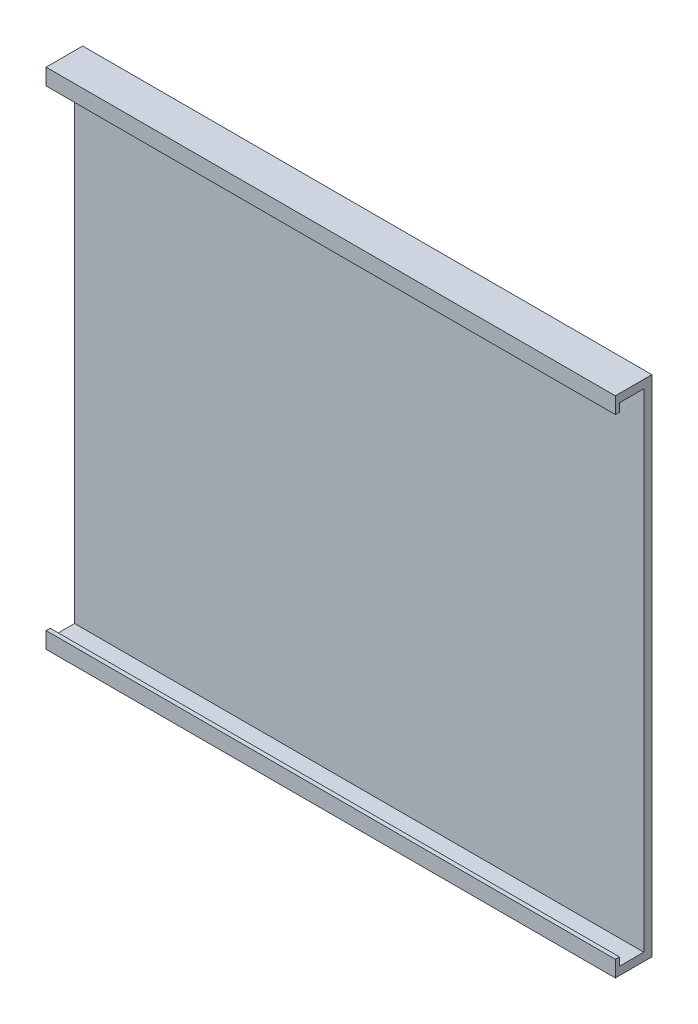
ISO-10303-21;
HEADER;
FILE_DESCRIPTION(('STEP AP214'),'2;1');
FILE_NAME('part.step','',(''),(''),'','','');
FILE_SCHEMA(('AUTOMOTIVE_DESIGN { 1 0 10303 214 1 1 1 1 }'));
ENDSEC;
DATA;
#1=APPLICATION_CONTEXT('core data for automotive mechanical design processes');
#2=APPLICATION_PROTOCOL_DEFINITION('international standard','automotive_design',2000,#1);
#3=PRODUCT_CONTEXT('',#1,'mechanical');
#4=PRODUCT('Part','Part','',(#3));
#5=PRODUCT_RELATED_PRODUCT_CATEGORY('part','',(#4));
#6=PRODUCT_DEFINITION_FORMATION('','',#4);
#7=PRODUCT_DEFINITION_CONTEXT('part definition',#1,'design');
#8=PRODUCT_DEFINITION('design','',#6,#7);
#9=PRODUCT_DEFINITION_SHAPE('','',#8);
#10=(LENGTH_UNIT() NAMED_UNIT(*) SI_UNIT(.MILLI.,.METRE.));
#11=(NAMED_UNIT(*) PLANE_ANGLE_UNIT() SI_UNIT($,.RADIAN.));
#12=(NAMED_UNIT(*) SI_UNIT($,.STERADIAN.) SOLID_ANGLE_UNIT());
#13=UNCERTAINTY_MEASURE_WITH_UNIT(LENGTH_MEASURE(1.E-05),#10,'distance_accuracy_value','');
#14=(GEOMETRIC_REPRESENTATION_CONTEXT(3) GLOBAL_UNCERTAINTY_ASSIGNED_CONTEXT((#13)) GLOBAL_UNIT_ASSIGNED_CONTEXT((#10,
#11,#12)) REPRESENTATION_CONTEXT('',''));
#15=CARTESIAN_POINT('',(0.,0.,0.));
#16=DIRECTION('',(0.,0.,1.));
#17=DIRECTION('',(1.,0.,0.));
#18=AXIS2_PLACEMENT_3D('',#15,#16,#17);
#19=CARTESIAN_POINT('',(0.,0.,1.));
#20=DIRECTION('',(0.,0.,-1.));
#21=DIRECTION('',(-1.,0.,0.));
#22=AXIS2_PLACEMENT_3D('',#19,#20,#21);
#23=PLANE('',#22);
#24=DIRECTION('',(0.,-1.,0.));
#25=VECTOR('',#24,1.);
#26=CARTESIAN_POINT('',(-45.8,45.6,1.));
#27=LINE('',#26,#25);
#28=CARTESIAN_POINT('',(-45.8,44.6,1.));
#29=VERTEX_POINT('',#28);
#30=CARTESIAN_POINT('',(-45.8,-15.4,1.));
#31=VERTEX_POINT('',#30);
#32=EDGE_CURVE('E240',#29,#31,#27,.T.);
#33=ORIENTED_EDGE('',*,*,#32,.T.);
#34=DIRECTION('',(-1.,0.,0.));
#35=VECTOR('',#34,1.);
#36=CARTESIAN_POINT('',(24.2,-15.4,1.));
#37=LINE('',#36,#35);
#38=CARTESIAN_POINT('',(24.2,-15.4,1.));
#39=VERTEX_POINT('',#38);
#40=EDGE_CURVE('E171',#39,#31,#37,.T.);
#41=ORIENTED_EDGE('',*,*,#40,.F.);
#42=DIRECTION('',(0.,-1.,0.));
#43=VECTOR('',#42,1.);
#44=CARTESIAN_POINT('',(24.2,45.6,1.));
#45=LINE('',#44,#43);
#46=CARTESIAN_POINT('',(24.2,44.6,1.));
#47=VERTEX_POINT('',#46);
#48=EDGE_CURVE('E237',#47,#39,#45,.T.);
#49=ORIENTED_EDGE('',*,*,#48,.F.);
#50=DIRECTION('',(-1.,0.,0.));
#51=VECTOR('',#50,1.);
#52=CARTESIAN_POINT('',(24.2,44.6,1.));
#53=LINE('',#52,#51);
#54=EDGE_CURVE('E141',#47,#29,#53,.T.);
#55=ORIENTED_EDGE('',*,*,#54,.T.);
#56=EDGE_LOOP('',(#33,#41,#49,#55));
#57=FACE_BOUND('',#56,.T.);
#58=ADVANCED_FACE('F45',(#57),#23,.F.);
#59=CARTESIAN_POINT('',(-45.8,-16.4,1.));
#60=DIRECTION('',(0.,1.,0.));
#61=DIRECTION('',(0.,0.,1.));
#62=AXIS2_PLACEMENT_3D('',#59,#60,#61);
#63=PLANE('',#62);
#64=DIRECTION('',(1.,0.,0.));
#65=VECTOR('',#64,1.);
#66=CARTESIAN_POINT('',(-45.8,-16.4,0.));
#67=LINE('',#66,#65);
#68=CARTESIAN_POINT('',(-45.8,-16.4,0.));
#69=VERTEX_POINT('',#68);
#70=CARTESIAN_POINT('',(24.2,-16.4,0.));
#71=VERTEX_POINT('',#70);
#72=EDGE_CURVE('E236',#69,#71,#67,.T.);
#73=ORIENTED_EDGE('',*,*,#72,.T.);
#74=DIRECTION('',(0.,0.,-1.));
#75=VECTOR('',#74,1.);
#76=CARTESIAN_POINT('',(24.2,-16.4,1.));
#77=LINE('',#76,#75);
#78=CARTESIAN_POINT('',(24.2,-16.4,4.5));
#79=VERTEX_POINT('',#78);
#80=EDGE_CURVE('E11',#79,#71,#77,.T.);
#81=ORIENTED_EDGE('',*,*,#80,.F.);
#82=DIRECTION('',(1.,0.,0.));
#83=VECTOR('',#82,1.);
#84=CARTESIAN_POINT('',(-45.8,-16.4,4.5));
#85=LINE('',#84,#83);
#86=CARTESIAN_POINT('',(-45.8,-16.4,4.5));
#87=VERTEX_POINT('',#86);
#88=EDGE_CURVE('E207',#87,#79,#85,.T.);
#89=ORIENTED_EDGE('',*,*,#88,.F.);
#90=DIRECTION('',(0.,0.,-1.));
#91=VECTOR('',#90,1.);
#92=CARTESIAN_POINT('',(-45.8,-16.4,1.));
#93=LINE('',#92,#91);
#94=EDGE_CURVE('E244',#87,#69,#93,.T.);
#95=ORIENTED_EDGE('',*,*,#94,.T.);
#96=EDGE_LOOP('',(#73,#81,#89,#95));
#97=FACE_BOUND('',#96,.T.);
#98=ADVANCED_FACE('F47',(#97),#63,.F.);
#99=CARTESIAN_POINT('',(24.2,45.6,1.));
#100=DIRECTION('',(1.,0.,0.));
#101=DIRECTION('',(0.,1.,0.));
#102=AXIS2_PLACEMENT_3D('',#99,#100,#101);
#103=PLANE('',#102);
#104=DIRECTION('',(0.,0.,-1.));
#105=VECTOR('',#104,1.);
#106=CARTESIAN_POINT('',(24.2,44.6,1.));
#107=LINE('',#106,#105);
#108=CARTESIAN_POINT('',(24.2,44.6,4.));
#109=VERTEX_POINT('',#108);
#110=EDGE_CURVE('E146',#109,#47,#107,.T.);
#111=ORIENTED_EDGE('',*,*,#110,.T.);
#112=ORIENTED_EDGE('',*,*,#48,.T.);
#113=DIRECTION('',(0.,0.,1.));
#114=VECTOR('',#113,1.);
#115=CARTESIAN_POINT('',(24.2,-15.4,1.));
#116=LINE('',#115,#114);
#117=CARTESIAN_POINT('',(24.2,-15.4,4.));
#118=VERTEX_POINT('',#117);
#119=EDGE_CURVE('E184',#39,#118,#116,.T.);
#120=ORIENTED_EDGE('',*,*,#119,.T.);
#121=DIRECTION('',(0.,1.,0.));
#122=VECTOR('',#121,1.);
#123=CARTESIAN_POINT('',(24.2,-14.4,4.));
#124=LINE('',#123,#122);
#125=CARTESIAN_POINT('',(24.2,-14.4,4.));
#126=VERTEX_POINT('',#125);
#127=EDGE_CURVE('E175',#118,#126,#124,.T.);
#128=ORIENTED_EDGE('',*,*,#127,.T.);
#129=DIRECTION('',(0.,0.,-1.));
#130=VECTOR('',#129,1.);
#131=CARTESIAN_POINT('',(24.2,-14.4,4.5));
#132=LINE('',#131,#130);
#133=CARTESIAN_POINT('',(24.2,-14.4,4.5));
#134=VERTEX_POINT('',#133);
#135=EDGE_CURVE('E167',#134,#126,#132,.T.);
#136=ORIENTED_EDGE('',*,*,#135,.F.);
#137=DIRECTION('',(0.,1.,0.));
#138=VECTOR('',#137,1.);
#139=CARTESIAN_POINT('',(24.2,-14.4,4.5));
#140=LINE('',#139,#138);
#141=EDGE_CURVE('E204',#79,#134,#140,.T.);
#142=ORIENTED_EDGE('',*,*,#141,.F.);
#143=ORIENTED_EDGE('',*,*,#80,.T.);
#144=DIRECTION('',(0.,-1.,0.));
#145=VECTOR('',#144,1.);
#146=CARTESIAN_POINT('',(24.2,45.6,0.));
#147=LINE('',#146,#145);
#148=CARTESIAN_POINT('',(24.2,45.6,0.));
#149=VERTEX_POINT('',#148);
#150=EDGE_CURVE('E248',#149,#71,#147,.T.);
#151=ORIENTED_EDGE('',*,*,#150,.F.);
#152=DIRECTION('',(0.,0.,-1.));
#153=VECTOR('',#152,1.);
#154=CARTESIAN_POINT('',(24.2,45.6,1.));
#155=LINE('',#154,#153);
#156=CARTESIAN_POINT('',(24.2,45.6,4.5));
#157=VERTEX_POINT('',#156);
#158=EDGE_CURVE('E54',#157,#149,#155,.T.);
#159=ORIENTED_EDGE('',*,*,#158,.F.);
#160=DIRECTION('',(0.,1.,0.));
#161=VECTOR('',#160,1.);
#162=CARTESIAN_POINT('',(24.2,45.6,4.5));
#163=LINE('',#162,#161);
#164=CARTESIAN_POINT('',(24.2,43.6,4.5));
#165=VERTEX_POINT('',#164);
#166=EDGE_CURVE('E222',#165,#157,#163,.T.);
#167=ORIENTED_EDGE('',*,*,#166,.F.);
#168=DIRECTION('',(0.,0.,-1.));
#169=VECTOR('',#168,1.);
#170=CARTESIAN_POINT('',(24.2,43.6,4.5));
#171=LINE('',#170,#169);
#172=CARTESIAN_POINT('',(24.2,43.6,4.));
#173=VERTEX_POINT('',#172);
#174=EDGE_CURVE('E156',#165,#173,#171,.T.);
#175=ORIENTED_EDGE('',*,*,#174,.T.);
#176=DIRECTION('',(0.,1.,0.));
#177=VECTOR('',#176,1.);
#178=CARTESIAN_POINT('',(24.2,43.6,4.));
#179=LINE('',#178,#177);
#180=EDGE_CURVE('E61',#173,#109,#179,.T.);
#181=ORIENTED_EDGE('',*,*,#180,.T.);
#182=EDGE_LOOP('',(#111,#112,#120,#128,#136,#142,#143,#151,#159,#167,#175,#181));
#183=FACE_BOUND('',#182,.T.);
#184=ADVANCED_FACE('F153',(#183),#103,.T.);
#185=CARTESIAN_POINT('',(-45.8,45.6,1.));
#186=DIRECTION('',(0.,1.,0.));
#187=DIRECTION('',(0.,0.,1.));
#188=AXIS2_PLACEMENT_3D('',#185,#186,#187);
#189=PLANE('',#188);
#190=DIRECTION('',(1.,0.,0.));
#191=VECTOR('',#190,1.);
#192=CARTESIAN_POINT('',(-45.8,45.6,0.));
#193=LINE('',#192,#191);
#194=CARTESIAN_POINT('',(-45.8,45.6,0.));
#195=VERTEX_POINT('',#194);
#196=EDGE_CURVE('E252',#195,#149,#193,.T.);
#197=ORIENTED_EDGE('',*,*,#196,.F.);
#198=DIRECTION('',(0.,0.,-1.));
#199=VECTOR('',#198,1.);
#200=CARTESIAN_POINT('',(-45.8,45.6,1.));
#201=LINE('',#200,#199);
#202=CARTESIAN_POINT('',(-45.8,45.6,4.5));
#203=VERTEX_POINT('',#202);
#204=EDGE_CURVE('E261',#203,#195,#201,.T.);
#205=ORIENTED_EDGE('',*,*,#204,.F.);
#206=DIRECTION('',(-1.,0.,0.));
#207=VECTOR('',#206,1.);
#208=CARTESIAN_POINT('',(-45.8,45.6,4.5));
#209=LINE('',#208,#207);
#210=EDGE_CURVE('E226',#157,#203,#209,.T.);
#211=ORIENTED_EDGE('',*,*,#210,.F.);
#212=ORIENTED_EDGE('',*,*,#158,.T.);
#213=EDGE_LOOP('',(#197,#205,#211,#212));
#214=FACE_BOUND('',#213,.T.);
#215=ADVANCED_FACE('F268',(#214),#189,.T.);
#216=CARTESIAN_POINT('',(-45.8,45.6,1.));
#217=DIRECTION('',(1.,0.,0.));
#218=DIRECTION('',(0.,1.,0.));
#219=AXIS2_PLACEMENT_3D('',#216,#217,#218);
#220=PLANE('',#219);
#221=ORIENTED_EDGE('',*,*,#32,.F.);
#222=DIRECTION('',(0.,0.,-1.));
#223=VECTOR('',#222,1.);
#224=CARTESIAN_POINT('',(-45.8,44.6,1.));
#225=LINE('',#224,#223);
#226=CARTESIAN_POINT('',(-45.8,44.6,4.));
#227=VERTEX_POINT('',#226);
#228=EDGE_CURVE('E158',#227,#29,#225,.T.);
#229=ORIENTED_EDGE('',*,*,#228,.F.);
#230=DIRECTION('',(0.,1.,0.));
#231=VECTOR('',#230,1.);
#232=CARTESIAN_POINT('',(-45.8,43.6,4.));
#233=LINE('',#232,#231);
#234=CARTESIAN_POINT('',(-45.8,43.6,4.));
#235=VERTEX_POINT('',#234);
#236=EDGE_CURVE('E136',#235,#227,#233,.T.);
#237=ORIENTED_EDGE('',*,*,#236,.F.);
#238=DIRECTION('',(0.,0.,-1.));
#239=VECTOR('',#238,1.);
#240=CARTESIAN_POINT('',(-45.8,43.6,4.5));
#241=LINE('',#240,#239);
#242=CARTESIAN_POINT('',(-45.8,43.6,4.5));
#243=VERTEX_POINT('',#242);
#244=EDGE_CURVE('E232',#243,#235,#241,.T.);
#245=ORIENTED_EDGE('',*,*,#244,.F.);
#246=DIRECTION('',(0.,-1.,0.));
#247=VECTOR('',#246,1.);
#248=CARTESIAN_POINT('',(-45.8,45.6,4.5));
#249=LINE('',#248,#247);
#250=EDGE_CURVE('E215',#203,#243,#249,.T.);
#251=ORIENTED_EDGE('',*,*,#250,.F.);
#252=ORIENTED_EDGE('',*,*,#204,.T.);
#253=DIRECTION('',(0.,-1.,0.));
#254=VECTOR('',#253,1.);
#255=CARTESIAN_POINT('',(-45.8,45.6,0.));
#256=LINE('',#255,#254);
#257=EDGE_CURVE('E241',#195,#69,#256,.T.);
#258=ORIENTED_EDGE('',*,*,#257,.T.);
#259=ORIENTED_EDGE('',*,*,#94,.F.);
#260=DIRECTION('',(0.,-1.,0.));
#261=VECTOR('',#260,1.);
#262=CARTESIAN_POINT('',(-45.8,-14.4,4.5));
#263=LINE('',#262,#261);
#264=CARTESIAN_POINT('',(-45.8,-14.4,4.5));
#265=VERTEX_POINT('',#264);
#266=EDGE_CURVE('E211',#265,#87,#263,.T.);
#267=ORIENTED_EDGE('',*,*,#266,.F.);
#268=DIRECTION('',(0.,0.,-1.));
#269=VECTOR('',#268,1.);
#270=CARTESIAN_POINT('',(-45.8,-14.4,4.5));
#271=LINE('',#270,#269);
#272=CARTESIAN_POINT('',(-45.8,-14.4,4.));
#273=VERTEX_POINT('',#272);
#274=EDGE_CURVE('E197',#265,#273,#271,.T.);
#275=ORIENTED_EDGE('',*,*,#274,.T.);
#276=DIRECTION('',(0.,1.,0.));
#277=VECTOR('',#276,1.);
#278=CARTESIAN_POINT('',(-45.8,-14.4,4.));
#279=LINE('',#278,#277);
#280=CARTESIAN_POINT('',(-45.8,-15.4,4.));
#281=VERTEX_POINT('',#280);
#282=EDGE_CURVE('E69',#281,#273,#279,.T.);
#283=ORIENTED_EDGE('',*,*,#282,.F.);
#284=DIRECTION('',(0.,0.,1.));
#285=VECTOR('',#284,1.);
#286=CARTESIAN_POINT('',(-45.8,-15.4,1.));
#287=LINE('',#286,#285);
#288=EDGE_CURVE('E164',#31,#281,#287,.T.);
#289=ORIENTED_EDGE('',*,*,#288,.F.);
#290=EDGE_LOOP('',(#221,#229,#237,#245,#251,#252,#258,#259,#267,#275,#283,#289));
#291=FACE_BOUND('',#290,.T.);
#292=ADVANCED_FACE('F275',(#291),#220,.F.);
#293=CARTESIAN_POINT('',(0.,0.,0.));
#294=DIRECTION('',(0.,0.,-1.));
#295=DIRECTION('',(-1.,0.,0.));
#296=AXIS2_PLACEMENT_3D('',#293,#294,#295);
#297=PLANE('',#296);
#298=ORIENTED_EDGE('',*,*,#72,.F.);
#299=ORIENTED_EDGE('',*,*,#257,.F.);
#300=ORIENTED_EDGE('',*,*,#196,.T.);
#301=ORIENTED_EDGE('',*,*,#150,.T.);
#302=EDGE_LOOP('',(#298,#299,#300,#301));
#303=FACE_BOUND('',#302,.T.);
#304=ADVANCED_FACE('F273',(#303),#297,.T.);
#305=CARTESIAN_POINT('',(-45.8,43.6,4.5));
#306=DIRECTION('',(0.,1.,0.));
#307=DIRECTION('',(0.,0.,1.));
#308=AXIS2_PLACEMENT_3D('',#305,#306,#307);
#309=PLANE('',#308);
#310=ORIENTED_EDGE('',*,*,#244,.T.);
#311=DIRECTION('',(-1.,0.,0.));
#312=VECTOR('',#311,1.);
#313=CARTESIAN_POINT('',(24.2,43.6,4.));
#314=LINE('',#313,#312);
#315=EDGE_CURVE('E142',#173,#235,#314,.T.);
#316=ORIENTED_EDGE('',*,*,#315,.F.);
#317=ORIENTED_EDGE('',*,*,#174,.F.);
#318=DIRECTION('',(1.,0.,0.));
#319=VECTOR('',#318,1.);
#320=CARTESIAN_POINT('',(-45.8,43.6,4.5));
#321=LINE('',#320,#319);
#322=EDGE_CURVE('E219',#243,#165,#321,.T.);
#323=ORIENTED_EDGE('',*,*,#322,.F.);
#324=EDGE_LOOP('',(#310,#316,#317,#323));
#325=FACE_BOUND('',#324,.T.);
#326=ADVANCED_FACE('F304',(#325),#309,.F.);
#327=CARTESIAN_POINT('',(0.,0.,4.5));
#328=DIRECTION('',(0.,0.,1.));
#329=DIRECTION('',(1.,0.,0.));
#330=AXIS2_PLACEMENT_3D('',#327,#328,#329);
#331=PLANE('',#330);
#332=ORIENTED_EDGE('',*,*,#250,.T.);
#333=ORIENTED_EDGE('',*,*,#322,.T.);
#334=ORIENTED_EDGE('',*,*,#166,.T.);
#335=ORIENTED_EDGE('',*,*,#210,.T.);
#336=EDGE_LOOP('',(#332,#333,#334,#335));
#337=FACE_BOUND('',#336,.T.);
#338=ADVANCED_FACE('F326',(#337),#331,.T.);
#339=CARTESIAN_POINT('',(-45.8,-14.4,4.5));
#340=DIRECTION('',(0.,-1.,0.));
#341=DIRECTION('',(0.,0.,-1.));
#342=AXIS2_PLACEMENT_3D('',#339,#340,#341);
#343=PLANE('',#342);
#344=ORIENTED_EDGE('',*,*,#135,.T.);
#345=DIRECTION('',(-1.,0.,0.));
#346=VECTOR('',#345,1.);
#347=CARTESIAN_POINT('',(24.2,-14.4,4.));
#348=LINE('',#347,#346);
#349=EDGE_CURVE('E179',#126,#273,#348,.T.);
#350=ORIENTED_EDGE('',*,*,#349,.T.);
#351=ORIENTED_EDGE('',*,*,#274,.F.);
#352=DIRECTION('',(-1.,0.,0.));
#353=VECTOR('',#352,1.);
#354=CARTESIAN_POINT('',(-45.8,-14.4,4.5));
#355=LINE('',#354,#353);
#356=EDGE_CURVE('E201',#134,#265,#355,.T.);
#357=ORIENTED_EDGE('',*,*,#356,.F.);
#358=EDGE_LOOP('',(#344,#350,#351,#357));
#359=FACE_BOUND('',#358,.T.);
#360=ADVANCED_FACE('F286',(#359),#343,.F.);
#361=CARTESIAN_POINT('',(0.,0.,4.5));
#362=DIRECTION('',(0.,0.,1.));
#363=DIRECTION('',(1.,0.,0.));
#364=AXIS2_PLACEMENT_3D('',#361,#362,#363);
#365=PLANE('',#364);
#366=ORIENTED_EDGE('',*,*,#266,.T.);
#367=ORIENTED_EDGE('',*,*,#88,.T.);
#368=ORIENTED_EDGE('',*,*,#141,.T.);
#369=ORIENTED_EDGE('',*,*,#356,.T.);
#370=EDGE_LOOP('',(#366,#367,#368,#369));
#371=FACE_BOUND('',#370,.T.);
#372=ADVANCED_FACE('F281',(#371),#365,.T.);
#373=CARTESIAN_POINT('',(24.2,-14.4,4.));
#374=DIRECTION('',(0.,0.,1.));
#375=DIRECTION('',(1.,0.,0.));
#376=AXIS2_PLACEMENT_3D('',#373,#374,#375);
#377=PLANE('',#376);
#378=ORIENTED_EDGE('',*,*,#282,.T.);
#379=ORIENTED_EDGE('',*,*,#349,.F.);
#380=ORIENTED_EDGE('',*,*,#127,.F.);
#381=DIRECTION('',(-1.,0.,0.));
#382=VECTOR('',#381,1.);
#383=CARTESIAN_POINT('',(24.2,-15.4,4.));
#384=LINE('',#383,#382);
#385=EDGE_CURVE('E176',#118,#281,#384,.T.);
#386=ORIENTED_EDGE('',*,*,#385,.T.);
#387=EDGE_LOOP('',(#378,#379,#380,#386));
#388=FACE_BOUND('',#387,.T.);
#389=ADVANCED_FACE('F289',(#388),#377,.F.);
#390=CARTESIAN_POINT('',(24.2,-15.4,1.));
#391=DIRECTION('',(0.,-1.,0.));
#392=DIRECTION('',(1.,0.,0.));
#393=AXIS2_PLACEMENT_3D('',#390,#391,#392);
#394=PLANE('',#393);
#395=ORIENTED_EDGE('',*,*,#288,.T.);
#396=ORIENTED_EDGE('',*,*,#385,.F.);
#397=ORIENTED_EDGE('',*,*,#119,.F.);
#398=ORIENTED_EDGE('',*,*,#40,.T.);
#399=EDGE_LOOP('',(#395,#396,#397,#398));
#400=FACE_BOUND('',#399,.T.);
#401=ADVANCED_FACE('F293',(#400),#394,.F.);
#402=CARTESIAN_POINT('',(24.2,44.6,1.));
#403=DIRECTION('',(0.,1.,0.));
#404=DIRECTION('',(0.,0.,1.));
#405=AXIS2_PLACEMENT_3D('',#402,#403,#404);
#406=PLANE('',#405);
#407=ORIENTED_EDGE('',*,*,#228,.T.);
#408=ORIENTED_EDGE('',*,*,#54,.F.);
#409=ORIENTED_EDGE('',*,*,#110,.F.);
#410=DIRECTION('',(-1.,0.,0.));
#411=VECTOR('',#410,1.);
#412=CARTESIAN_POINT('',(24.2,44.6,4.));
#413=LINE('',#412,#411);
#414=EDGE_CURVE('E132',#109,#227,#413,.T.);
#415=ORIENTED_EDGE('',*,*,#414,.T.);
#416=EDGE_LOOP('',(#407,#408,#409,#415));
#417=FACE_BOUND('',#416,.T.);
#418=ADVANCED_FACE('F147',(#417),#406,.F.);
#419=CARTESIAN_POINT('',(24.2,43.6,4.));
#420=DIRECTION('',(0.,0.,1.));
#421=DIRECTION('',(1.,0.,0.));
#422=AXIS2_PLACEMENT_3D('',#419,#420,#421);
#423=PLANE('',#422);
#424=ORIENTED_EDGE('',*,*,#236,.T.);
#425=ORIENTED_EDGE('',*,*,#414,.F.);
#426=ORIENTED_EDGE('',*,*,#180,.F.);
#427=ORIENTED_EDGE('',*,*,#315,.T.);
#428=EDGE_LOOP('',(#424,#425,#426,#427));
#429=FACE_BOUND('',#428,.T.);
#430=ADVANCED_FACE('F134',(#429),#423,.F.);
#431=CLOSED_SHELL('',(#58,#98,#184,#215,#292,#304,#326,#338,#360,#372,#389,#401,#418,#430));
#432=MANIFOLD_SOLID_BREP('B2',#431);
#433=ADVANCED_BREP_SHAPE_REPRESENTATION('',(#18,#432),#14);
#434=SHAPE_DEFINITION_REPRESENTATION(#9,#433);
ENDSEC;
END-ISO-10303-21;
